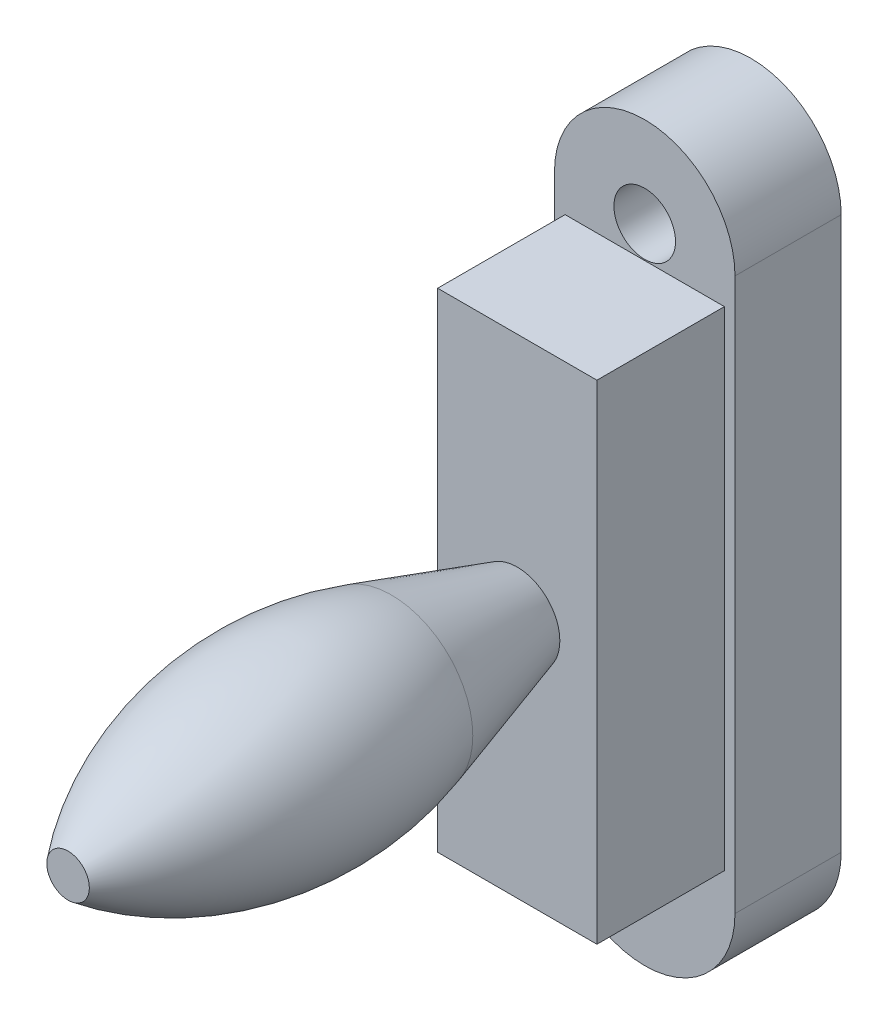
ISO-10303-21;
HEADER;
FILE_DESCRIPTION(('STEP AP214'),'2;1');
FILE_NAME('part.step','',(''),(''),'','','');
FILE_SCHEMA(('AUTOMOTIVE_DESIGN { 1 0 10303 214 1 1 1 1 }'));
ENDSEC;
DATA;
#1=APPLICATION_CONTEXT('core data for automotive mechanical design processes');
#2=APPLICATION_PROTOCOL_DEFINITION('international standard','automotive_design',2000,#1);
#3=PRODUCT_CONTEXT('',#1,'mechanical');
#4=PRODUCT('Part','Part','',(#3));
#5=PRODUCT_RELATED_PRODUCT_CATEGORY('part','',(#4));
#6=PRODUCT_DEFINITION_FORMATION('','',#4);
#7=PRODUCT_DEFINITION_CONTEXT('part definition',#1,'design');
#8=PRODUCT_DEFINITION('design','',#6,#7);
#9=PRODUCT_DEFINITION_SHAPE('','',#8);
#10=(LENGTH_UNIT() NAMED_UNIT(*) SI_UNIT(.MILLI.,.METRE.));
#11=(NAMED_UNIT(*) PLANE_ANGLE_UNIT() SI_UNIT($,.RADIAN.));
#12=(NAMED_UNIT(*) SI_UNIT($,.STERADIAN.) SOLID_ANGLE_UNIT());
#13=UNCERTAINTY_MEASURE_WITH_UNIT(LENGTH_MEASURE(1.E-05),#10,'distance_accuracy_value','');
#14=(GEOMETRIC_REPRESENTATION_CONTEXT(3) GLOBAL_UNCERTAINTY_ASSIGNED_CONTEXT((#13)) GLOBAL_UNIT_ASSIGNED_CONTEXT((#10,
#11,#12)) REPRESENTATION_CONTEXT('',''));
#15=CARTESIAN_POINT('',(0.,0.,0.));
#16=DIRECTION('',(0.,0.,1.));
#17=DIRECTION('',(1.,0.,0.));
#18=AXIS2_PLACEMENT_3D('',#15,#16,#17);
#19=CARTESIAN_POINT('',(0.,0.,5.));
#20=DIRECTION('',(0.,0.,1.));
#21=DIRECTION('',(1.,0.,0.));
#22=AXIS2_PLACEMENT_3D('',#19,#20,#21);
#23=PLANE('',#22);
#24=CARTESIAN_POINT('',(0.,0.,5.));
#25=DIRECTION('',(0.,0.,1.));
#26=DIRECTION('',(1.,0.,0.));
#27=AXIS2_PLACEMENT_3D('',#24,#25,#26);
#28=CIRCLE('',#27,1.45);
#29=CARTESIAN_POINT('',(1.45,0.,5.));
#30=VERTEX_POINT('',#29);
#31=EDGE_CURVE('E229',#30,#30,#28,.T.);
#32=ORIENTED_EDGE('',*,*,#31,.F.);
#33=EDGE_LOOP('',(#32));
#34=FACE_BOUND('',#33,.T.);
#35=CARTESIAN_POINT('',(0.,0.,5.));
#36=DIRECTION('',(0.,0.,1.));
#37=DIRECTION('',(1.,0.,0.));
#38=AXIS2_PLACEMENT_3D('',#35,#36,#37);
#39=CIRCLE('',#38,4.25);
#40=CARTESIAN_POINT('',(-4.25,0.,5.));
#41=VERTEX_POINT('',#40);
#42=CARTESIAN_POINT('',(4.25,0.,5.));
#43=VERTEX_POINT('',#42);
#44=EDGE_CURVE('E245',#41,#43,#39,.T.);
#45=ORIENTED_EDGE('',*,*,#44,.T.);
#46=DIRECTION('',(0.,1.,0.));
#47=VECTOR('',#46,1.);
#48=CARTESIAN_POINT('',(4.25,0.,5.));
#49=LINE('',#48,#47);
#50=CARTESIAN_POINT('',(4.25,26.,5.));
#51=VERTEX_POINT('',#50);
#52=EDGE_CURVE('E249',#43,#51,#49,.T.);
#53=ORIENTED_EDGE('',*,*,#52,.T.);
#54=CARTESIAN_POINT('',(0.,26.,5.));
#55=DIRECTION('',(0.,0.,1.));
#56=DIRECTION('',(1.,0.,0.));
#57=AXIS2_PLACEMENT_3D('',#54,#55,#56);
#58=CIRCLE('',#57,4.25);
#59=CARTESIAN_POINT('',(-4.25,26.,5.));
#60=VERTEX_POINT('',#59);
#61=EDGE_CURVE('E253',#51,#60,#58,.T.);
#62=ORIENTED_EDGE('',*,*,#61,.T.);
#63=DIRECTION('',(0.,-1.,0.));
#64=VECTOR('',#63,1.);
#65=CARTESIAN_POINT('',(-4.25,0.,5.));
#66=LINE('',#65,#64);
#67=EDGE_CURVE('E256',#60,#41,#66,.T.);
#68=ORIENTED_EDGE('',*,*,#67,.T.);
#69=EDGE_LOOP('',(#45,#53,#62,#68));
#70=FACE_BOUND('',#69,.T.);
#71=CARTESIAN_POINT('',(0.,26.,5.));
#72=DIRECTION('',(0.,0.,1.));
#73=DIRECTION('',(1.,0.,0.));
#74=AXIS2_PLACEMENT_3D('',#71,#72,#73);
#75=CIRCLE('',#74,1.45);
#76=CARTESIAN_POINT('',(1.45,26.,5.));
#77=VERTEX_POINT('',#76);
#78=EDGE_CURVE('E237',#77,#77,#75,.T.);
#79=ORIENTED_EDGE('',*,*,#78,.F.);
#80=EDGE_LOOP('',(#79));
#81=FACE_BOUND('',#80,.T.);
#82=DIRECTION('',(0.,1.,0.));
#83=VECTOR('',#82,1.);
#84=CARTESIAN_POINT('',(3.75,1.5,5.));
#85=LINE('',#84,#83);
#86=CARTESIAN_POINT('',(3.75,1.5,5.));
#87=VERTEX_POINT('',#86);
#88=CARTESIAN_POINT('',(3.75,24.5,5.));
#89=VERTEX_POINT('',#88);
#90=EDGE_CURVE('E186',#87,#89,#85,.T.);
#91=ORIENTED_EDGE('',*,*,#90,.F.);
#92=DIRECTION('',(1.,0.,0.));
#93=VECTOR('',#92,1.);
#94=CARTESIAN_POINT('',(-3.75,1.5,5.));
#95=LINE('',#94,#93);
#96=CARTESIAN_POINT('',(-3.75,1.5,5.));
#97=VERTEX_POINT('',#96);
#98=EDGE_CURVE('E183',#97,#87,#95,.T.);
#99=ORIENTED_EDGE('',*,*,#98,.F.);
#100=DIRECTION('',(0.,-1.,0.));
#101=VECTOR('',#100,1.);
#102=CARTESIAN_POINT('',(-3.75,24.5,5.));
#103=LINE('',#102,#101);
#104=CARTESIAN_POINT('',(-3.75,24.5,5.));
#105=VERTEX_POINT('',#104);
#106=EDGE_CURVE('E135',#105,#97,#103,.T.);
#107=ORIENTED_EDGE('',*,*,#106,.F.);
#108=DIRECTION('',(-1.,0.,0.));
#109=VECTOR('',#108,1.);
#110=CARTESIAN_POINT('',(3.75,24.5,5.));
#111=LINE('',#110,#109);
#112=EDGE_CURVE('E189',#89,#105,#111,.T.);
#113=ORIENTED_EDGE('',*,*,#112,.F.);
#114=EDGE_LOOP('',(#91,#99,#107,#113));
#115=FACE_BOUND('',#114,.T.);
#116=ADVANCED_FACE('F38',(#34,#70,#81,#115),#23,.T.);
#117=CARTESIAN_POINT('',(0.,0.,0.));
#118=DIRECTION('',(0.,0.,1.));
#119=DIRECTION('',(1.,0.,0.));
#120=AXIS2_PLACEMENT_3D('',#117,#118,#119);
#121=PLANE('',#120);
#122=CARTESIAN_POINT('',(0.,0.,0.));
#123=DIRECTION('',(0.,0.,1.));
#124=DIRECTION('',(1.,0.,0.));
#125=AXIS2_PLACEMENT_3D('',#122,#123,#124);
#126=CIRCLE('',#125,1.45);
#127=CARTESIAN_POINT('',(1.45,0.,0.));
#128=VERTEX_POINT('',#127);
#129=EDGE_CURVE('E228',#128,#128,#126,.T.);
#130=ORIENTED_EDGE('',*,*,#129,.T.);
#131=EDGE_LOOP('',(#130));
#132=FACE_BOUND('',#131,.T.);
#133=CARTESIAN_POINT('',(0.,26.,0.));
#134=DIRECTION('',(0.,0.,1.));
#135=DIRECTION('',(1.,0.,0.));
#136=AXIS2_PLACEMENT_3D('',#133,#134,#135);
#137=CIRCLE('',#136,1.45);
#138=CARTESIAN_POINT('',(1.45,26.,0.));
#139=VERTEX_POINT('',#138);
#140=EDGE_CURVE('E233',#139,#139,#137,.T.);
#141=ORIENTED_EDGE('',*,*,#140,.T.);
#142=EDGE_LOOP('',(#141));
#143=FACE_BOUND('',#142,.T.);
#144=CARTESIAN_POINT('',(0.,0.,0.));
#145=DIRECTION('',(0.,0.,1.));
#146=DIRECTION('',(1.,0.,0.));
#147=AXIS2_PLACEMENT_3D('',#144,#145,#146);
#148=CIRCLE('',#147,4.25);
#149=CARTESIAN_POINT('',(-4.25,0.,0.));
#150=VERTEX_POINT('',#149);
#151=CARTESIAN_POINT('',(4.25,0.,0.));
#152=VERTEX_POINT('',#151);
#153=EDGE_CURVE('E241',#150,#152,#148,.T.);
#154=ORIENTED_EDGE('',*,*,#153,.F.);
#155=DIRECTION('',(0.,-1.,0.));
#156=VECTOR('',#155,1.);
#157=CARTESIAN_POINT('',(-4.25,0.,0.));
#158=LINE('',#157,#156);
#159=CARTESIAN_POINT('',(-4.25,26.,0.));
#160=VERTEX_POINT('',#159);
#161=EDGE_CURVE('E250',#160,#150,#158,.T.);
#162=ORIENTED_EDGE('',*,*,#161,.F.);
#163=CARTESIAN_POINT('',(0.,26.,0.));
#164=DIRECTION('',(0.,0.,1.));
#165=DIRECTION('',(1.,0.,0.));
#166=AXIS2_PLACEMENT_3D('',#163,#164,#165);
#167=CIRCLE('',#166,4.25);
#168=CARTESIAN_POINT('',(4.25,26.,0.));
#169=VERTEX_POINT('',#168);
#170=EDGE_CURVE('E266',#169,#160,#167,.T.);
#171=ORIENTED_EDGE('',*,*,#170,.F.);
#172=DIRECTION('',(0.,1.,0.));
#173=VECTOR('',#172,1.);
#174=CARTESIAN_POINT('',(4.25,0.,0.));
#175=LINE('',#174,#173);
#176=EDGE_CURVE('E263',#152,#169,#175,.T.);
#177=ORIENTED_EDGE('',*,*,#176,.F.);
#178=EDGE_LOOP('',(#154,#162,#171,#177));
#179=FACE_BOUND('',#178,.T.);
#180=DIRECTION('',(0.,-1.,0.));
#181=VECTOR('',#180,1.);
#182=CARTESIAN_POINT('',(-2.25,3.,0.));
#183=LINE('',#182,#181);
#184=CARTESIAN_POINT('',(-2.25,23.,0.));
#185=VERTEX_POINT('',#184);
#186=CARTESIAN_POINT('',(-2.25,3.,0.));
#187=VERTEX_POINT('',#186);
#188=EDGE_CURVE('E63',#185,#187,#183,.T.);
#189=ORIENTED_EDGE('',*,*,#188,.T.);
#190=DIRECTION('',(1.,0.,0.));
#191=VECTOR('',#190,1.);
#192=CARTESIAN_POINT('',(-2.25,3.,0.));
#193=LINE('',#192,#191);
#194=CARTESIAN_POINT('',(2.25,3.,0.));
#195=VERTEX_POINT('',#194);
#196=EDGE_CURVE('E204',#187,#195,#193,.T.);
#197=ORIENTED_EDGE('',*,*,#196,.T.);
#198=DIRECTION('',(0.,1.,0.));
#199=VECTOR('',#198,1.);
#200=CARTESIAN_POINT('',(2.25,3.,0.));
#201=LINE('',#200,#199);
#202=CARTESIAN_POINT('',(2.25,23.,0.));
#203=VERTEX_POINT('',#202);
#204=EDGE_CURVE('E208',#195,#203,#201,.T.);
#205=ORIENTED_EDGE('',*,*,#204,.T.);
#206=DIRECTION('',(-1.,0.,0.));
#207=VECTOR('',#206,1.);
#208=CARTESIAN_POINT('',(-2.25,23.,0.));
#209=LINE('',#208,#207);
#210=EDGE_CURVE('E212',#203,#185,#209,.T.);
#211=ORIENTED_EDGE('',*,*,#210,.T.);
#212=EDGE_LOOP('',(#189,#197,#205,#211));
#213=FACE_BOUND('',#212,.T.);
#214=ADVANCED_FACE('F295',(#132,#143,#179,#213),#121,.F.);
#215=CARTESIAN_POINT('',(0.,0.,5.));
#216=DIRECTION('',(0.,0.,-1.));
#217=DIRECTION('',(-1.,0.,0.));
#218=AXIS2_PLACEMENT_3D('',#215,#216,#217);
#219=CYLINDRICAL_SURFACE('',#218,4.25);
#220=ORIENTED_EDGE('',*,*,#153,.T.);
#221=DIRECTION('',(0.,0.,-1.));
#222=VECTOR('',#221,1.);
#223=CARTESIAN_POINT('',(4.25,0.,5.));
#224=LINE('',#223,#222);
#225=EDGE_CURVE('E42',#43,#152,#224,.T.);
#226=ORIENTED_EDGE('',*,*,#225,.F.);
#227=ORIENTED_EDGE('',*,*,#44,.F.);
#228=DIRECTION('',(0.,0.,-1.));
#229=VECTOR('',#228,1.);
#230=CARTESIAN_POINT('',(-4.25,0.,5.));
#231=LINE('',#230,#229);
#232=EDGE_CURVE('E259',#41,#150,#231,.T.);
#233=ORIENTED_EDGE('',*,*,#232,.T.);
#234=EDGE_LOOP('',(#220,#226,#227,#233));
#235=FACE_BOUND('',#234,.T.);
#236=ADVANCED_FACE('F40',(#235),#219,.T.);
#237=CARTESIAN_POINT('',(4.25,0.,5.));
#238=DIRECTION('',(-1.,0.,0.));
#239=DIRECTION('',(0.,0.,1.));
#240=AXIS2_PLACEMENT_3D('',#237,#238,#239);
#241=PLANE('',#240);
#242=ORIENTED_EDGE('',*,*,#176,.T.);
#243=DIRECTION('',(0.,0.,-1.));
#244=VECTOR('',#243,1.);
#245=CARTESIAN_POINT('',(4.25,26.,5.));
#246=LINE('',#245,#244);
#247=EDGE_CURVE('E277',#51,#169,#246,.T.);
#248=ORIENTED_EDGE('',*,*,#247,.F.);
#249=ORIENTED_EDGE('',*,*,#52,.F.);
#250=ORIENTED_EDGE('',*,*,#225,.T.);
#251=EDGE_LOOP('',(#242,#248,#249,#250));
#252=FACE_BOUND('',#251,.T.);
#253=ADVANCED_FACE('F288',(#252),#241,.F.);
#254=CARTESIAN_POINT('',(0.,26.,5.));
#255=DIRECTION('',(0.,0.,-1.));
#256=DIRECTION('',(-1.,0.,0.));
#257=AXIS2_PLACEMENT_3D('',#254,#255,#256);
#258=CYLINDRICAL_SURFACE('',#257,4.25);
#259=ORIENTED_EDGE('',*,*,#170,.T.);
#260=DIRECTION('',(0.,0.,-1.));
#261=VECTOR('',#260,1.);
#262=CARTESIAN_POINT('',(-4.25,26.,5.));
#263=LINE('',#262,#261);
#264=EDGE_CURVE('E274',#60,#160,#263,.T.);
#265=ORIENTED_EDGE('',*,*,#264,.F.);
#266=ORIENTED_EDGE('',*,*,#61,.F.);
#267=ORIENTED_EDGE('',*,*,#247,.T.);
#268=EDGE_LOOP('',(#259,#265,#266,#267));
#269=FACE_BOUND('',#268,.T.);
#270=ADVANCED_FACE('F298',(#269),#258,.T.);
#271=CARTESIAN_POINT('',(-4.25,0.,5.));
#272=DIRECTION('',(1.,0.,0.));
#273=DIRECTION('',(0.,0.,-1.));
#274=AXIS2_PLACEMENT_3D('',#271,#272,#273);
#275=PLANE('',#274);
#276=ORIENTED_EDGE('',*,*,#161,.T.);
#277=ORIENTED_EDGE('',*,*,#232,.F.);
#278=ORIENTED_EDGE('',*,*,#67,.F.);
#279=ORIENTED_EDGE('',*,*,#264,.T.);
#280=EDGE_LOOP('',(#276,#277,#278,#279));
#281=FACE_BOUND('',#280,.T.);
#282=ADVANCED_FACE('F301',(#281),#275,.F.);
#283=CARTESIAN_POINT('',(0.,26.,5.));
#284=DIRECTION('',(0.,0.,-1.));
#285=DIRECTION('',(-1.,0.,0.));
#286=AXIS2_PLACEMENT_3D('',#283,#284,#285);
#287=CYLINDRICAL_SURFACE('',#286,1.45);
#288=ORIENTED_EDGE('',*,*,#78,.T.);
#289=EDGE_LOOP('',(#288));
#290=FACE_BOUND('',#289,.T.);
#291=ORIENTED_EDGE('',*,*,#140,.F.);
#292=EDGE_LOOP('',(#291));
#293=FACE_BOUND('',#292,.T.);
#294=ADVANCED_FACE('F347',(#290,#293),#287,.F.);
#295=CARTESIAN_POINT('',(0.,0.,5.));
#296=DIRECTION('',(0.,0.,-1.));
#297=DIRECTION('',(-1.,0.,0.));
#298=AXIS2_PLACEMENT_3D('',#295,#296,#297);
#299=CYLINDRICAL_SURFACE('',#298,1.45);
#300=ORIENTED_EDGE('',*,*,#31,.T.);
#301=EDGE_LOOP('',(#300));
#302=FACE_BOUND('',#301,.T.);
#303=ORIENTED_EDGE('',*,*,#129,.F.);
#304=EDGE_LOOP('',(#303));
#305=FACE_BOUND('',#304,.T.);
#306=ADVANCED_FACE('F344',(#302,#305),#299,.F.);
#307=CARTESIAN_POINT('',(-2.25,3.,5.));
#308=DIRECTION('',(1.,0.,0.));
#309=DIRECTION('',(0.,0.,-1.));
#310=AXIS2_PLACEMENT_3D('',#307,#308,#309);
#311=PLANE('',#310);
#312=ORIENTED_EDGE('',*,*,#188,.F.);
#313=DIRECTION('',(0.,0.,-1.));
#314=VECTOR('',#313,1.);
#315=CARTESIAN_POINT('',(-2.25,23.,5.));
#316=LINE('',#315,#314);
#317=CARTESIAN_POINT('',(-2.25,23.,10.));
#318=VERTEX_POINT('',#317);
#319=EDGE_CURVE('E216',#318,#185,#316,.T.);
#320=ORIENTED_EDGE('',*,*,#319,.F.);
#321=DIRECTION('',(0.,-1.,0.));
#322=VECTOR('',#321,1.);
#323=CARTESIAN_POINT('',(-2.25,23.,10.));
#324=LINE('',#323,#322);
#325=CARTESIAN_POINT('',(-2.25,3.,10.));
#326=VERTEX_POINT('',#325);
#327=EDGE_CURVE('E175',#318,#326,#324,.T.);
#328=ORIENTED_EDGE('',*,*,#327,.T.);
#329=DIRECTION('',(0.,0.,-1.));
#330=VECTOR('',#329,1.);
#331=CARTESIAN_POINT('',(-2.25,3.,5.));
#332=LINE('',#331,#330);
#333=EDGE_CURVE('E225',#326,#187,#332,.T.);
#334=ORIENTED_EDGE('',*,*,#333,.T.);
#335=EDGE_LOOP('',(#312,#320,#328,#334));
#336=FACE_BOUND('',#335,.T.);
#337=ADVANCED_FACE('F340',(#336),#311,.T.);
#338=CARTESIAN_POINT('',(-2.25,3.,5.));
#339=DIRECTION('',(0.,1.,0.));
#340=DIRECTION('',(0.,0.,1.));
#341=AXIS2_PLACEMENT_3D('',#338,#339,#340);
#342=PLANE('',#341);
#343=CARTESIAN_POINT('',(0.,3.,7.15389129413069));
#344=DIRECTION('',(0.,1.,0.));
#345=DIRECTION('',(0.,0.,1.));
#346=AXIS2_PLACEMENT_3D('',#343,#344,#345);
#347=CIRCLE('',#346,1.25);
#348=CARTESIAN_POINT('',(0.,3.,8.40389129413069));
#349=VERTEX_POINT('',#348);
#350=EDGE_CURVE('E480',#349,#349,#347,.F.);
#351=ORIENTED_EDGE('',*,*,#350,.T.);
#352=EDGE_LOOP('',(#351));
#353=FACE_BOUND('',#352,.T.);
#354=ORIENTED_EDGE('',*,*,#196,.F.);
#355=ORIENTED_EDGE('',*,*,#333,.F.);
#356=DIRECTION('',(1.,0.,0.));
#357=VECTOR('',#356,1.);
#358=CARTESIAN_POINT('',(-2.25,3.,10.));
#359=LINE('',#358,#357);
#360=CARTESIAN_POINT('',(2.25,3.,10.));
#361=VERTEX_POINT('',#360);
#362=EDGE_CURVE('E179',#326,#361,#359,.T.);
#363=ORIENTED_EDGE('',*,*,#362,.T.);
#364=DIRECTION('',(0.,0.,-1.));
#365=VECTOR('',#364,1.);
#366=CARTESIAN_POINT('',(2.25,3.,5.));
#367=LINE('',#366,#365);
#368=EDGE_CURVE('E222',#361,#195,#367,.T.);
#369=ORIENTED_EDGE('',*,*,#368,.T.);
#370=EDGE_LOOP('',(#354,#355,#363,#369));
#371=FACE_BOUND('',#370,.T.);
#372=ADVANCED_FACE('F336',(#353,#371),#342,.T.);
#373=CARTESIAN_POINT('',(2.25,3.,5.));
#374=DIRECTION('',(-1.,0.,0.));
#375=DIRECTION('',(0.,0.,1.));
#376=AXIS2_PLACEMENT_3D('',#373,#374,#375);
#377=PLANE('',#376);
#378=ORIENTED_EDGE('',*,*,#204,.F.);
#379=ORIENTED_EDGE('',*,*,#368,.F.);
#380=DIRECTION('',(0.,1.,0.));
#381=VECTOR('',#380,1.);
#382=CARTESIAN_POINT('',(2.25,3.,10.));
#383=LINE('',#382,#381);
#384=CARTESIAN_POINT('',(2.25,23.,10.));
#385=VERTEX_POINT('',#384);
#386=EDGE_CURVE('E167',#361,#385,#383,.T.);
#387=ORIENTED_EDGE('',*,*,#386,.T.);
#388=DIRECTION('',(0.,0.,-1.));
#389=VECTOR('',#388,1.);
#390=CARTESIAN_POINT('',(2.25,23.,5.));
#391=LINE('',#390,#389);
#392=EDGE_CURVE('E219',#385,#203,#391,.T.);
#393=ORIENTED_EDGE('',*,*,#392,.T.);
#394=EDGE_LOOP('',(#378,#379,#387,#393));
#395=FACE_BOUND('',#394,.T.);
#396=ADVANCED_FACE('F332',(#395),#377,.T.);
#397=CARTESIAN_POINT('',(-2.25,23.,5.));
#398=DIRECTION('',(0.,-1.,0.));
#399=DIRECTION('',(0.,0.,-1.));
#400=AXIS2_PLACEMENT_3D('',#397,#398,#399);
#401=PLANE('',#400);
#402=ORIENTED_EDGE('',*,*,#210,.F.);
#403=ORIENTED_EDGE('',*,*,#392,.F.);
#404=DIRECTION('',(-1.,0.,0.));
#405=VECTOR('',#404,1.);
#406=CARTESIAN_POINT('',(2.25,23.,10.));
#407=LINE('',#406,#405);
#408=EDGE_CURVE('E171',#385,#318,#407,.T.);
#409=ORIENTED_EDGE('',*,*,#408,.T.);
#410=ORIENTED_EDGE('',*,*,#319,.T.);
#411=EDGE_LOOP('',(#402,#403,#409,#410));
#412=FACE_BOUND('',#411,.T.);
#413=ADVANCED_FACE('F328',(#412),#401,.T.);
#414=CARTESIAN_POINT('',(-3.75,1.5,10.));
#415=DIRECTION('',(0.,1.,0.));
#416=DIRECTION('',(-1.,0.,0.));
#417=AXIS2_PLACEMENT_3D('',#414,#415,#416);
#418=PLANE('',#417);
#419=CARTESIAN_POINT('',(0.,1.5,7.15389129413069));
#420=DIRECTION('',(0.,-1.,0.));
#421=DIRECTION('',(1.,0.,0.));
#422=AXIS2_PLACEMENT_3D('',#419,#420,#421);
#423=CIRCLE('',#422,1.25);
#424=CARTESIAN_POINT('',(1.25,1.5,7.15389129413069));
#425=VERTEX_POINT('',#424);
#426=EDGE_CURVE('E483',#425,#425,#423,.T.);
#427=ORIENTED_EDGE('',*,*,#426,.F.);
#428=EDGE_LOOP('',(#427));
#429=FACE_BOUND('',#428,.T.);
#430=ORIENTED_EDGE('',*,*,#98,.T.);
#431=DIRECTION('',(0.,0.,-1.));
#432=VECTOR('',#431,1.);
#433=CARTESIAN_POINT('',(3.75,1.5,10.));
#434=LINE('',#433,#432);
#435=CARTESIAN_POINT('',(3.75,1.5,11.));
#436=VERTEX_POINT('',#435);
#437=EDGE_CURVE('E144',#436,#87,#434,.T.);
#438=ORIENTED_EDGE('',*,*,#437,.F.);
#439=DIRECTION('',(1.,0.,0.));
#440=VECTOR('',#439,1.);
#441=CARTESIAN_POINT('',(-3.75,1.5,11.));
#442=LINE('',#441,#440);
#443=CARTESIAN_POINT('',(-3.75,1.5,11.));
#444=VERTEX_POINT('',#443);
#445=EDGE_CURVE('E142',#444,#436,#442,.T.);
#446=ORIENTED_EDGE('',*,*,#445,.F.);
#447=DIRECTION('',(0.,0.,-1.));
#448=VECTOR('',#447,1.);
#449=CARTESIAN_POINT('',(-3.75,1.5,10.));
#450=LINE('',#449,#448);
#451=EDGE_CURVE('E129',#444,#97,#450,.T.);
#452=ORIENTED_EDGE('',*,*,#451,.T.);
#453=EDGE_LOOP('',(#430,#438,#446,#452));
#454=FACE_BOUND('',#453,.T.);
#455=ADVANCED_FACE('F143',(#429,#454),#418,.F.);
#456=CARTESIAN_POINT('',(3.75,1.5,10.));
#457=DIRECTION('',(-1.,0.,0.));
#458=DIRECTION('',(0.,0.,1.));
#459=AXIS2_PLACEMENT_3D('',#456,#457,#458);
#460=PLANE('',#459);
#461=ORIENTED_EDGE('',*,*,#90,.T.);
#462=DIRECTION('',(0.,0.,-1.));
#463=VECTOR('',#462,1.);
#464=CARTESIAN_POINT('',(3.75,24.5,10.));
#465=LINE('',#464,#463);
#466=CARTESIAN_POINT('',(3.75,24.5,11.));
#467=VERTEX_POINT('',#466);
#468=EDGE_CURVE('E196',#467,#89,#465,.T.);
#469=ORIENTED_EDGE('',*,*,#468,.F.);
#470=DIRECTION('',(0.,1.,0.));
#471=VECTOR('',#470,1.);
#472=CARTESIAN_POINT('',(3.75,24.5,11.));
#473=LINE('',#472,#471);
#474=EDGE_CURVE('E149',#436,#467,#473,.T.);
#475=ORIENTED_EDGE('',*,*,#474,.F.);
#476=ORIENTED_EDGE('',*,*,#437,.T.);
#477=EDGE_LOOP('',(#461,#469,#475,#476));
#478=FACE_BOUND('',#477,.T.);
#479=ADVANCED_FACE('F312',(#478),#460,.F.);
#480=CARTESIAN_POINT('',(3.75,24.5,10.));
#481=DIRECTION('',(0.,-1.,0.));
#482=DIRECTION('',(0.,0.,-1.));
#483=AXIS2_PLACEMENT_3D('',#480,#481,#482);
#484=PLANE('',#483);
#485=ORIENTED_EDGE('',*,*,#112,.T.);
#486=DIRECTION('',(0.,0.,-1.));
#487=VECTOR('',#486,1.);
#488=CARTESIAN_POINT('',(-3.75,24.5,10.));
#489=LINE('',#488,#487);
#490=CARTESIAN_POINT('',(-3.75,24.5,11.));
#491=VERTEX_POINT('',#490);
#492=EDGE_CURVE('E55',#491,#105,#489,.T.);
#493=ORIENTED_EDGE('',*,*,#492,.F.);
#494=DIRECTION('',(-1.,0.,0.));
#495=VECTOR('',#494,1.);
#496=CARTESIAN_POINT('',(-3.75,24.5,11.));
#497=LINE('',#496,#495);
#498=EDGE_CURVE('E154',#467,#491,#497,.T.);
#499=ORIENTED_EDGE('',*,*,#498,.F.);
#500=ORIENTED_EDGE('',*,*,#468,.T.);
#501=EDGE_LOOP('',(#485,#493,#499,#500));
#502=FACE_BOUND('',#501,.T.);
#503=ADVANCED_FACE('F314',(#502),#484,.F.);
#504=CARTESIAN_POINT('',(-3.75,24.5,10.));
#505=DIRECTION('',(1.,0.,0.));
#506=DIRECTION('',(0.,1.,0.));
#507=AXIS2_PLACEMENT_3D('',#504,#505,#506);
#508=PLANE('',#507);
#509=ORIENTED_EDGE('',*,*,#106,.T.);
#510=ORIENTED_EDGE('',*,*,#451,.F.);
#511=DIRECTION('',(0.,-1.,0.));
#512=VECTOR('',#511,1.);
#513=CARTESIAN_POINT('',(-3.75,24.5,11.));
#514=LINE('',#513,#512);
#515=EDGE_CURVE('E133',#491,#444,#514,.T.);
#516=ORIENTED_EDGE('',*,*,#515,.F.);
#517=ORIENTED_EDGE('',*,*,#492,.T.);
#518=EDGE_LOOP('',(#509,#510,#516,#517));
#519=FACE_BOUND('',#518,.T.);
#520=ADVANCED_FACE('F131',(#519),#508,.F.);
#521=CARTESIAN_POINT('',(0.,0.,10.));
#522=DIRECTION('',(0.,0.,1.));
#523=DIRECTION('',(1.,0.,0.));
#524=AXIS2_PLACEMENT_3D('',#521,#522,#523);
#525=PLANE('',#524);
#526=ORIENTED_EDGE('',*,*,#408,.F.);
#527=ORIENTED_EDGE('',*,*,#386,.F.);
#528=ORIENTED_EDGE('',*,*,#362,.F.);
#529=ORIENTED_EDGE('',*,*,#327,.F.);
#530=EDGE_LOOP('',(#526,#527,#528,#529));
#531=FACE_BOUND('',#530,.T.);
#532=ADVANCED_FACE('F321',(#531),#525,.F.);
#533=CARTESIAN_POINT('',(0.,0.,11.));
#534=DIRECTION('',(0.,0.,1.));
#535=DIRECTION('',(1.,0.,0.));
#536=AXIS2_PLACEMENT_3D('',#533,#534,#535);
#537=PLANE('',#536);
#538=CARTESIAN_POINT('',(0.,13.,11.));
#539=DIRECTION('',(0.,0.,1.));
#540=DIRECTION('',(1.,0.,0.));
#541=AXIS2_PLACEMENT_3D('',#538,#539,#540);
#542=CIRCLE('',#541,2.0038936411729);
#543=CARTESIAN_POINT('',(2.0038936411729,13.,11.));
#544=VERTEX_POINT('',#543);
#545=EDGE_CURVE('E11',#544,#544,#542,.T.);
#546=ORIENTED_EDGE('',*,*,#545,.F.);
#547=EDGE_LOOP('',(#546));
#548=FACE_BOUND('',#547,.T.);
#549=ORIENTED_EDGE('',*,*,#515,.T.);
#550=ORIENTED_EDGE('',*,*,#445,.T.);
#551=ORIENTED_EDGE('',*,*,#474,.T.);
#552=ORIENTED_EDGE('',*,*,#498,.T.);
#553=EDGE_LOOP('',(#549,#550,#551,#552));
#554=FACE_BOUND('',#553,.T.);
#555=ADVANCED_FACE('F152',(#548,#554),#537,.T.);
#556=CARTESIAN_POINT('',(0.,13.,11.));
#557=DIRECTION('',(0.,0.,1.));
#558=DIRECTION('',(1.,0.,0.));
#559=AXIS2_PLACEMENT_3D('',#556,#557,#558);
#560=CONICAL_SURFACE('',#559,2.0038936411729,0.298888383364018);
#561=CARTESIAN_POINT('',(0.,13.,16.9244504188922));
#562=DIRECTION('',(0.,0.,1.));
#563=DIRECTION('',(1.,0.,0.));
#564=AXIS2_PLACEMENT_3D('',#561,#562,#563);
#565=CIRCLE('',#564,3.82932749438792);
#566=CARTESIAN_POINT('',(3.82932749438792,13.,16.9244504188922));
#567=VERTEX_POINT('',#566);
#568=EDGE_CURVE('E156',#567,#567,#565,.T.);
#569=ORIENTED_EDGE('',*,*,#568,.F.);
#570=EDGE_LOOP('',(#569));
#571=FACE_BOUND('',#570,.T.);
#572=ORIENTED_EDGE('',*,*,#545,.T.);
#573=EDGE_LOOP('',(#572));
#574=FACE_BOUND('',#573,.T.);
#575=ADVANCED_FACE('F428',(#571,#574),#560,.T.);
#576=CARTESIAN_POINT('',(0.,13.,21.838776622933));
#577=DIRECTION('',(0.,0.,1.));
#578=DIRECTION('',(1.,0.,0.));
#579=AXIS2_PLACEMENT_3D('',#576,#577,#578);
#580=DEGENERATE_TOROIDAL_SURFACE('',#579,12.1201312530899,16.6893929301584,.F.);
#581=CARTESIAN_POINT('',(0.,13.,32.1512401213199));
#582=DIRECTION('',(0.,0.,1.));
#583=DIRECTION('',(1.,0.,0.));
#584=AXIS2_PLACEMENT_3D('',#581,#582,#583);
#585=CIRCLE('',#584,1.00194682058645);
#586=CARTESIAN_POINT('',(1.00194682058645,13.,32.1512401213199));
#587=VERTEX_POINT('',#586);
#588=EDGE_CURVE('E160',#587,#587,#585,.T.);
#589=ORIENTED_EDGE('',*,*,#588,.F.);
#590=EDGE_LOOP('',(#589));
#591=FACE_BOUND('',#590,.T.);
#592=ORIENTED_EDGE('',*,*,#568,.T.);
#593=EDGE_LOOP('',(#592));
#594=FACE_BOUND('',#593,.T.);
#595=ADVANCED_FACE('F438',(#591,#594),#580,.F.);
#596=CARTESIAN_POINT('',(0.,14.0019468205864,32.1512401213199));
#597=DIRECTION('',(0.,0.,-1.));
#598=DIRECTION('',(-1.,0.,0.));
#599=AXIS2_PLACEMENT_3D('',#596,#597,#598);
#600=PLANE('',#599);
#601=ORIENTED_EDGE('',*,*,#588,.T.);
#602=EDGE_LOOP('',(#601));
#603=FACE_BOUND('',#602,.T.);
#604=ADVANCED_FACE('F448',(#603),#600,.F.);
#605=CARTESIAN_POINT('',(0.,30.251,7.15389129413069));
#606=DIRECTION('',(0.,-1.,0.));
#607=DIRECTION('',(1.,0.,0.));
#608=AXIS2_PLACEMENT_3D('',#605,#606,#607);
#609=CYLINDRICAL_SURFACE('',#608,1.25);
#610=ORIENTED_EDGE('',*,*,#350,.F.);
#611=EDGE_LOOP('',(#610));
#612=FACE_BOUND('',#611,.T.);
#613=ORIENTED_EDGE('',*,*,#426,.T.);
#614=EDGE_LOOP('',(#613));
#615=FACE_BOUND('',#614,.T.);
#616=ADVANCED_FACE('F457',(#612,#615),#609,.F.);
#617=CLOSED_SHELL('',(#116,#214,#236,#253,#270,#282,#294,#306,#337,#372,#396,#413,#455,#479,
#503,#520,#532,#555,#575,#595,#604,#616));
#618=MANIFOLD_SOLID_BREP('B2',#617);
#619=ADVANCED_BREP_SHAPE_REPRESENTATION('',(#18,#618),#14);
#620=SHAPE_DEFINITION_REPRESENTATION(#9,#619);
ENDSEC;
END-ISO-10303-21;
